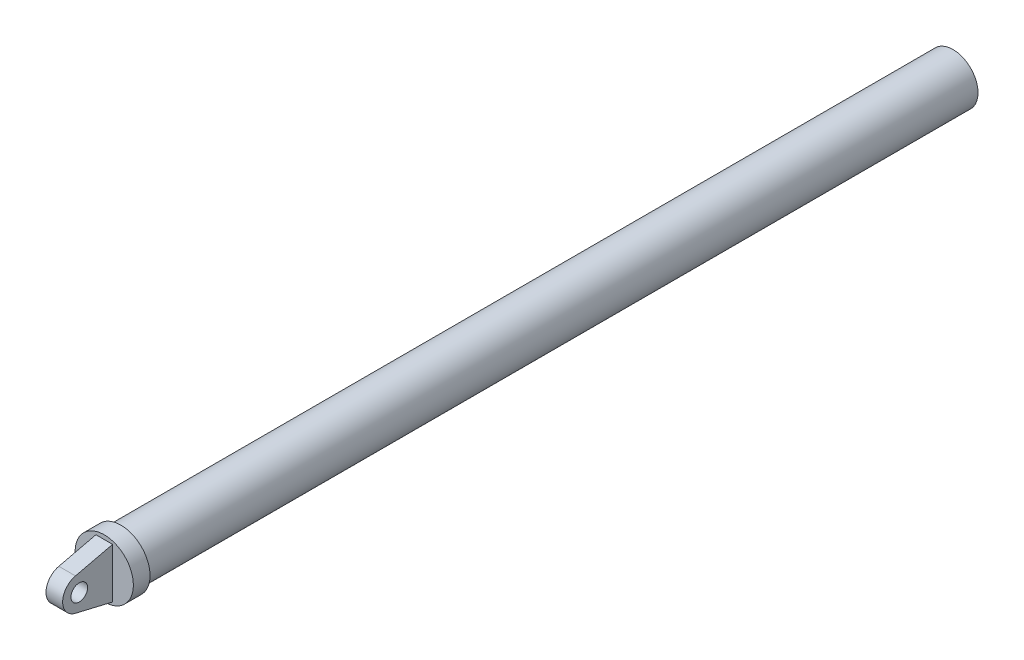
ISO-10303-21;
HEADER;
FILE_DESCRIPTION(('STEP AP214'),'2;1');
FILE_NAME('part.step','',(''),(''),'','','');
FILE_SCHEMA(('AUTOMOTIVE_DESIGN { 1 0 10303 214 1 1 1 1 }'));
ENDSEC;
DATA;
#1=APPLICATION_CONTEXT('core data for automotive mechanical design processes');
#2=APPLICATION_PROTOCOL_DEFINITION('international standard','automotive_design',2000,#1);
#3=PRODUCT_CONTEXT('',#1,'mechanical');
#4=PRODUCT('Part','Part','',(#3));
#5=PRODUCT_RELATED_PRODUCT_CATEGORY('part','',(#4));
#6=PRODUCT_DEFINITION_FORMATION('','',#4);
#7=PRODUCT_DEFINITION_CONTEXT('part definition',#1,'design');
#8=PRODUCT_DEFINITION('design','',#6,#7);
#9=PRODUCT_DEFINITION_SHAPE('','',#8);
#10=(LENGTH_UNIT() NAMED_UNIT(*) SI_UNIT(.MILLI.,.METRE.));
#11=(NAMED_UNIT(*) PLANE_ANGLE_UNIT() SI_UNIT($,.RADIAN.));
#12=(NAMED_UNIT(*) SI_UNIT($,.STERADIAN.) SOLID_ANGLE_UNIT());
#13=UNCERTAINTY_MEASURE_WITH_UNIT(LENGTH_MEASURE(1.E-05),#10,'distance_accuracy_value','');
#14=(GEOMETRIC_REPRESENTATION_CONTEXT(3) GLOBAL_UNCERTAINTY_ASSIGNED_CONTEXT((#13)) GLOBAL_UNIT_ASSIGNED_CONTEXT((#10,
#11,#12)) REPRESENTATION_CONTEXT('',''));
#15=CARTESIAN_POINT('',(0.,0.,0.));
#16=DIRECTION('',(0.,0.,1.));
#17=DIRECTION('',(1.,0.,0.));
#18=AXIS2_PLACEMENT_3D('',#15,#16,#17);
#19=CARTESIAN_POINT('',(0.,-4.6074255521944E-12,250.));
#20=DIRECTION('',(0.,0.,-1.));
#21=DIRECTION('',(-0.357024646546326,0.934094963993743,0.));
#22=AXIS2_PLACEMENT_3D('',#19,#20,#21);
#23=CYLINDRICAL_SURFACE('',#22,15.);
#24=CARTESIAN_POINT('',(0.,-4.6074255521944E-12,250.));
#25=DIRECTION('',(0.,0.,1.));
#26=DIRECTION('',(0.357024646546326,-0.934094963993743,0.));
#27=AXIS2_PLACEMENT_3D('',#24,#25,#26);
#28=CIRCLE('',#27,15.);
#29=CARTESIAN_POINT('',(5.35536969819489,-14.0114244599107,250.));
#30=VERTEX_POINT('',#29);
#31=EDGE_CURVE('P0_E10',#30,#30,#28,.T.);
#32=ORIENTED_EDGE('',*,*,#31,.F.);
#33=EDGE_LOOP('',(#32));
#34=FACE_BOUND('',#33,.T.);
#35=CARTESIAN_POINT('',(0.,-4.6074255521944E-12,-250.));
#36=DIRECTION('',(0.,0.,1.));
#37=DIRECTION('',(0.357024646546326,-0.934094963993743,0.));
#38=AXIS2_PLACEMENT_3D('',#35,#36,#37);
#39=CIRCLE('',#38,15.);
#40=CARTESIAN_POINT('',(5.35536969819489,-14.0114244599107,-250.));
#41=VERTEX_POINT('',#40);
#42=EDGE_CURVE('P0_E18',#41,#41,#39,.T.);
#43=ORIENTED_EDGE('',*,*,#42,.T.);
#44=EDGE_LOOP('',(#43));
#45=FACE_BOUND('',#44,.T.);
#46=ADVANCED_FACE('P0_F15',(#34,#45),#23,.T.);
#47=CARTESIAN_POINT('',(0.,-4.6074255521944E-12,250.));
#48=DIRECTION('',(0.,0.,1.));
#49=DIRECTION('',(0.357024646546326,-0.934094963993743,0.));
#50=AXIS2_PLACEMENT_3D('',#47,#48,#49);
#51=PLANE('',#50);
#52=ORIENTED_EDGE('',*,*,#31,.T.);
#53=EDGE_LOOP('',(#52));
#54=FACE_BOUND('',#53,.T.);
#55=ADVANCED_FACE('P0_F30',(#54),#51,.T.);
#56=CARTESIAN_POINT('',(0.,-4.6074255521944E-12,-250.));
#57=DIRECTION('',(0.,0.,1.));
#58=DIRECTION('',(0.357024646546326,-0.934094963993743,0.));
#59=AXIS2_PLACEMENT_3D('',#56,#57,#58);
#60=PLANE('',#59);
#61=ORIENTED_EDGE('',*,*,#42,.F.);
#62=EDGE_LOOP('',(#61));
#63=FACE_BOUND('',#62,.T.);
#64=ADVANCED_FACE('P0_F28',(#63),#60,.F.);
#65=CLOSED_SHELL('',(#46,#55,#64));
#66=MANIFOLD_SOLID_BREP('P0_B1',#65);
#67=CARTESIAN_POINT('',(-5.,4.4626057581038,-25.164077124258));
#68=DIRECTION('',(-1.,0.,0.));
#69=DIRECTION('',(0.,-1.,0.));
#70=AXIS2_PLACEMENT_3D('',#67,#68,#69);
#71=PLANE('',#70);
#72=CARTESIAN_POINT('',(-5.,-4.61956861652624E-12,280.));
#73=DIRECTION('',(-1.,0.,0.));
#74=DIRECTION('',(0.,-1.,0.));
#75=AXIS2_PLACEMENT_3D('',#72,#73,#74);
#76=CIRCLE('',#75,5.00000000000001);
#77=CARTESIAN_POINT('',(-5.,-5.00000000000463,280.));
#78=VERTEX_POINT('',#77);
#79=EDGE_CURVE('P1_E65',#78,#78,#76,.T.);
#80=ORIENTED_EDGE('',*,*,#79,.F.);
#81=EDGE_LOOP('',(#80));
#82=FACE_BOUND('',#81,.T.);
#83=DIRECTION('',(0.,-0.2299090833947,0.973212111192935));
#84=VECTOR('',#83,1.);
#85=CARTESIAN_POINT('',(-5.,78.2485615184959,-7.73307594664263));
#86=LINE('',#85,#84);
#87=CARTESIAN_POINT('',(-5.,14.9999999999954,260.));
#88=VERTEX_POINT('',#87);
#89=CARTESIAN_POINT('',(-5.,9.73212111192474,282.299090833947));
#90=VERTEX_POINT('',#89);
#91=EDGE_CURVE('P1_E91',#88,#90,#86,.T.);
#92=ORIENTED_EDGE('',*,*,#91,.F.);
#93=DIRECTION('',(0.,-1.,0.));
#94=VECTOR('',#93,1.);
#95=CARTESIAN_POINT('',(-5.,4.4626057581038,260.));
#96=LINE('',#95,#94);
#97=CARTESIAN_POINT('',(-5.,-15.0000000000046,260.));
#98=VERTEX_POINT('',#97);
#99=EDGE_CURVE('P1_E79',#88,#98,#96,.T.);
#100=ORIENTED_EDGE('',*,*,#99,.T.);
#101=DIRECTION('',(0.,0.2299090833947,0.973212111192935));
#102=VECTOR('',#101,1.);
#103=CARTESIAN_POINT('',(-5.,-77.7767910224921,-5.73605715276028));
#104=LINE('',#103,#102);
#105=CARTESIAN_POINT('',(-5.,-9.73212111193398,282.299090833947));
#106=VERTEX_POINT('',#105);
#107=EDGE_CURVE('P1_E33',#98,#106,#104,.T.);
#108=ORIENTED_EDGE('',*,*,#107,.T.);
#109=CARTESIAN_POINT('',(-5.,-4.61956861652624E-12,280.));
#110=DIRECTION('',(-1.,0.,0.));
#111=DIRECTION('',(0.,-1.,0.));
#112=AXIS2_PLACEMENT_3D('',#109,#110,#111);
#113=CIRCLE('',#112,10.);
#114=EDGE_CURVE('P1_E57',#106,#90,#113,.T.);
#115=ORIENTED_EDGE('',*,*,#114,.T.);
#116=EDGE_LOOP('',(#92,#100,#108,#115));
#117=FACE_BOUND('',#116,.T.);
#118=ADVANCED_FACE('P1_F16',(#82,#117),#71,.T.);
#119=CARTESIAN_POINT('',(5.,4.4626057581038,-25.164077124258));
#120=DIRECTION('',(-1.,0.,0.));
#121=DIRECTION('',(0.,-1.,0.));
#122=AXIS2_PLACEMENT_3D('',#119,#120,#121);
#123=PLANE('',#122);
#124=CARTESIAN_POINT('',(5.,-4.61956861652624E-12,280.));
#125=DIRECTION('',(-1.,0.,0.));
#126=DIRECTION('',(0.,-1.,0.));
#127=AXIS2_PLACEMENT_3D('',#124,#125,#126);
#128=CIRCLE('',#127,5.00000000000001);
#129=CARTESIAN_POINT('',(5.,-5.00000000000463,280.));
#130=VERTEX_POINT('',#129);
#131=EDGE_CURVE('P1_E87',#130,#130,#128,.T.);
#132=ORIENTED_EDGE('',*,*,#131,.T.);
#133=EDGE_LOOP('',(#132));
#134=FACE_BOUND('',#133,.T.);
#135=DIRECTION('',(0.,-1.,0.));
#136=VECTOR('',#135,1.);
#137=CARTESIAN_POINT('',(5.,4.4626057581038,260.));
#138=LINE('',#137,#136);
#139=CARTESIAN_POINT('',(5.,14.9999999999954,260.));
#140=VERTEX_POINT('',#139);
#141=CARTESIAN_POINT('',(5.,-15.0000000000046,260.));
#142=VERTEX_POINT('',#141);
#143=EDGE_CURVE('P1_E10',#140,#142,#138,.T.);
#144=ORIENTED_EDGE('',*,*,#143,.F.);
#145=DIRECTION('',(0.,-0.2299090833947,0.973212111192935));
#146=VECTOR('',#145,1.);
#147=CARTESIAN_POINT('',(5.,78.2485615184959,-7.73307594664263));
#148=LINE('',#147,#146);
#149=CARTESIAN_POINT('',(5.,9.73212111192474,282.299090833947));
#150=VERTEX_POINT('',#149);
#151=EDGE_CURVE('P1_E66',#140,#150,#148,.T.);
#152=ORIENTED_EDGE('',*,*,#151,.T.);
#153=CARTESIAN_POINT('',(5.,-4.61956861652624E-12,280.));
#154=DIRECTION('',(-1.,0.,0.));
#155=DIRECTION('',(0.,-1.,0.));
#156=AXIS2_PLACEMENT_3D('',#153,#154,#155);
#157=CIRCLE('',#156,10.);
#158=CARTESIAN_POINT('',(5.,-9.73212111193398,282.299090833947));
#159=VERTEX_POINT('',#158);
#160=EDGE_CURVE('P1_E64',#159,#150,#157,.T.);
#161=ORIENTED_EDGE('',*,*,#160,.F.);
#162=DIRECTION('',(0.,0.2299090833947,0.973212111192935));
#163=VECTOR('',#162,1.);
#164=CARTESIAN_POINT('',(5.,-77.7767910224921,-5.73605715276028));
#165=LINE('',#164,#163);
#166=EDGE_CURVE('P1_E52',#142,#159,#165,.T.);
#167=ORIENTED_EDGE('',*,*,#166,.F.);
#168=EDGE_LOOP('',(#144,#152,#161,#167));
#169=FACE_BOUND('',#168,.T.);
#170=ADVANCED_FACE('P1_F62',(#134,#169),#123,.F.);
#171=CARTESIAN_POINT('',(-5.,-4.61956861652624E-12,280.));
#172=DIRECTION('',(1.,0.,0.));
#173=DIRECTION('',(0.,1.,0.));
#174=AXIS2_PLACEMENT_3D('',#171,#172,#173);
#175=CYLINDRICAL_SURFACE('',#174,10.);
#176=ORIENTED_EDGE('',*,*,#160,.T.);
#177=DIRECTION('',(1.,0.,0.));
#178=VECTOR('',#177,1.);
#179=CARTESIAN_POINT('',(-5.,9.73212111192474,282.299090833947));
#180=LINE('',#179,#178);
#181=EDGE_CURVE('P1_E25',#90,#150,#180,.T.);
#182=ORIENTED_EDGE('',*,*,#181,.F.);
#183=ORIENTED_EDGE('',*,*,#114,.F.);
#184=DIRECTION('',(1.,0.,0.));
#185=VECTOR('',#184,1.);
#186=CARTESIAN_POINT('',(-5.,-9.73212111193398,282.299090833947));
#187=LINE('',#186,#185);
#188=EDGE_CURVE('P1_E74',#106,#159,#187,.T.);
#189=ORIENTED_EDGE('',*,*,#188,.T.);
#190=EDGE_LOOP('',(#176,#182,#183,#189));
#191=FACE_BOUND('',#190,.T.);
#192=ADVANCED_FACE('P1_F120',(#191),#175,.T.);
#193=CARTESIAN_POINT('',(-5.,78.2485615184959,-7.73307594664263));
#194=DIRECTION('',(0.,0.973212111192935,0.2299090833947));
#195=DIRECTION('',(0.,0.2299090833947,-0.973212111192935));
#196=AXIS2_PLACEMENT_3D('',#193,#194,#195);
#197=PLANE('',#196);
#198=ORIENTED_EDGE('',*,*,#151,.F.);
#199=DIRECTION('',(1.,0.,0.));
#200=VECTOR('',#199,1.);
#201=CARTESIAN_POINT('',(-5.,14.9999999999954,260.));
#202=LINE('',#201,#200);
#203=EDGE_CURVE('P1_E73',#88,#140,#202,.T.);
#204=ORIENTED_EDGE('',*,*,#203,.F.);
#205=ORIENTED_EDGE('',*,*,#91,.T.);
#206=ORIENTED_EDGE('',*,*,#181,.T.);
#207=EDGE_LOOP('',(#198,#204,#205,#206));
#208=FACE_BOUND('',#207,.T.);
#209=ADVANCED_FACE('P1_F128',(#208),#197,.T.);
#210=CARTESIAN_POINT('',(-5.,-4.61956861652624E-12,280.));
#211=DIRECTION('',(1.,0.,0.));
#212=DIRECTION('',(0.,1.,0.));
#213=AXIS2_PLACEMENT_3D('',#210,#211,#212);
#214=CYLINDRICAL_SURFACE('',#213,5.00000000000001);
#215=ORIENTED_EDGE('',*,*,#79,.T.);
#216=EDGE_LOOP('',(#215));
#217=FACE_BOUND('',#216,.T.);
#218=ORIENTED_EDGE('',*,*,#131,.F.);
#219=EDGE_LOOP('',(#218));
#220=FACE_BOUND('',#219,.T.);
#221=ADVANCED_FACE('P1_F18',(#217,#220),#214,.F.);
#222=CARTESIAN_POINT('',(-5.,-77.7767910224921,-5.73605715276028));
#223=DIRECTION('',(0.,0.973212111192935,-0.2299090833947));
#224=DIRECTION('',(0.,-0.2299090833947,-0.973212111192935));
#225=AXIS2_PLACEMENT_3D('',#222,#223,#224);
#226=PLANE('',#225);
#227=ORIENTED_EDGE('',*,*,#166,.T.);
#228=ORIENTED_EDGE('',*,*,#188,.F.);
#229=ORIENTED_EDGE('',*,*,#107,.F.);
#230=DIRECTION('',(1.,0.,0.));
#231=VECTOR('',#230,1.);
#232=CARTESIAN_POINT('',(-5.,-15.0000000000046,260.));
#233=LINE('',#232,#231);
#234=EDGE_CURVE('P1_E69',#98,#142,#233,.T.);
#235=ORIENTED_EDGE('',*,*,#234,.T.);
#236=EDGE_LOOP('',(#227,#228,#229,#235));
#237=FACE_BOUND('',#236,.T.);
#238=ADVANCED_FACE('P1_F70',(#237),#226,.F.);
#239=CARTESIAN_POINT('',(0.,-4.6221707017402E-12,250.));
#240=DIRECTION('',(0.,0.,1.));
#241=DIRECTION('',(-1.,0.,0.));
#242=AXIS2_PLACEMENT_3D('',#239,#240,#241);
#243=CYLINDRICAL_SURFACE('',#242,17.5);
#244=CARTESIAN_POINT('',(0.,-4.6221707017402E-12,250.));
#245=DIRECTION('',(0.,0.,-1.));
#246=DIRECTION('',(1.,0.,0.));
#247=AXIS2_PLACEMENT_3D('',#244,#245,#246);
#248=CIRCLE('',#247,17.5);
#249=CARTESIAN_POINT('',(17.5,-4.62144211788029E-12,250.));
#250=VERTEX_POINT('',#249);
#251=EDGE_CURVE('P1_E97',#250,#250,#248,.T.);
#252=ORIENTED_EDGE('',*,*,#251,.F.);
#253=EDGE_LOOP('',(#252));
#254=FACE_BOUND('',#253,.T.);
#255=CARTESIAN_POINT('',(0.,-4.6221707017402E-12,260.));
#256=DIRECTION('',(0.,0.,-1.));
#257=DIRECTION('',(1.,0.,0.));
#258=AXIS2_PLACEMENT_3D('',#255,#256,#257);
#259=CIRCLE('',#258,17.5);
#260=CARTESIAN_POINT('',(17.5,-4.62144211788029E-12,260.));
#261=VERTEX_POINT('',#260);
#262=EDGE_CURVE('P1_E100',#261,#261,#259,.T.);
#263=ORIENTED_EDGE('',*,*,#262,.T.);
#264=EDGE_LOOP('',(#263));
#265=FACE_BOUND('',#264,.T.);
#266=ADVANCED_FACE('P1_F104',(#254,#265),#243,.T.);
#267=CARTESIAN_POINT('',(0.,-4.6221707017402E-12,250.));
#268=DIRECTION('',(0.,0.,-1.));
#269=DIRECTION('',(1.,0.,0.));
#270=AXIS2_PLACEMENT_3D('',#267,#268,#269);
#271=PLANE('',#270);
#272=ORIENTED_EDGE('',*,*,#251,.T.);
#273=EDGE_LOOP('',(#272));
#274=FACE_BOUND('',#273,.T.);
#275=ADVANCED_FACE('P1_F106',(#274),#271,.T.);
#276=CARTESIAN_POINT('',(0.,-4.6221707017402E-12,260.));
#277=DIRECTION('',(0.,0.,-1.));
#278=DIRECTION('',(1.,0.,0.));
#279=AXIS2_PLACEMENT_3D('',#276,#277,#278);
#280=PLANE('',#279);
#281=ORIENTED_EDGE('',*,*,#99,.F.);
#282=ORIENTED_EDGE('',*,*,#203,.T.);
#283=ORIENTED_EDGE('',*,*,#143,.T.);
#284=ORIENTED_EDGE('',*,*,#234,.F.);
#285=EDGE_LOOP('',(#281,#282,#283,#284));
#286=FACE_BOUND('',#285,.T.);
#287=ORIENTED_EDGE('',*,*,#262,.F.);
#288=EDGE_LOOP('',(#287));
#289=FACE_BOUND('',#288,.T.);
#290=ADVANCED_FACE('P1_F77',(#286,#289),#280,.F.);
#291=CLOSED_SHELL('',(#118,#170,#192,#209,#221,#238,#266,#275,#290));
#292=MANIFOLD_SOLID_BREP('P1_B1',#291);
#293=ADVANCED_BREP_SHAPE_REPRESENTATION('',(#18,#66,#292),#14);
#294=SHAPE_DEFINITION_REPRESENTATION(#9,#293);
ENDSEC;
END-ISO-10303-21;
